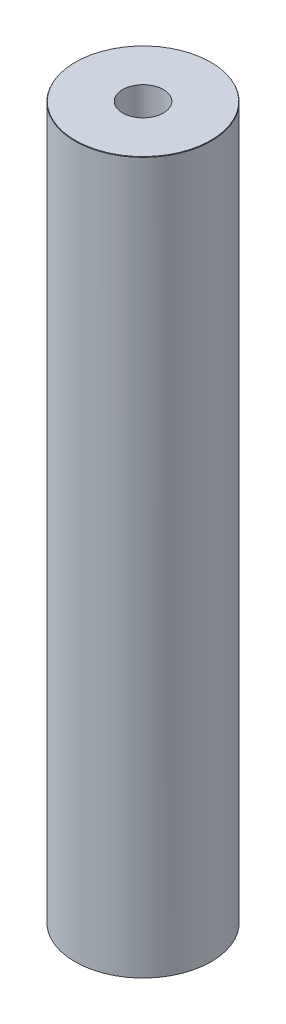
ISO-10303-21;
HEADER;
FILE_DESCRIPTION(('STEP AP214'),'2;1');
FILE_NAME('part.step','',(''),(''),'','','');
FILE_SCHEMA(('AUTOMOTIVE_DESIGN { 1 0 10303 214 1 1 1 1 }'));
ENDSEC;
DATA;
#1=APPLICATION_CONTEXT('core data for automotive mechanical design processes');
#2=APPLICATION_PROTOCOL_DEFINITION('international standard','automotive_design',2000,#1);
#3=PRODUCT_CONTEXT('',#1,'mechanical');
#4=PRODUCT('Part','Part','',(#3));
#5=PRODUCT_RELATED_PRODUCT_CATEGORY('part','',(#4));
#6=PRODUCT_DEFINITION_FORMATION('','',#4);
#7=PRODUCT_DEFINITION_CONTEXT('part definition',#1,'design');
#8=PRODUCT_DEFINITION('design','',#6,#7);
#9=PRODUCT_DEFINITION_SHAPE('','',#8);
#10=(LENGTH_UNIT() NAMED_UNIT(*) SI_UNIT(.MILLI.,.METRE.));
#11=(NAMED_UNIT(*) PLANE_ANGLE_UNIT() SI_UNIT($,.RADIAN.));
#12=(NAMED_UNIT(*) SI_UNIT($,.STERADIAN.) SOLID_ANGLE_UNIT());
#13=UNCERTAINTY_MEASURE_WITH_UNIT(LENGTH_MEASURE(1.E-05),#10,'distance_accuracy_value','');
#14=(GEOMETRIC_REPRESENTATION_CONTEXT(3) GLOBAL_UNCERTAINTY_ASSIGNED_CONTEXT((#13)) GLOBAL_UNIT_ASSIGNED_CONTEXT((#10,
#11,#12)) REPRESENTATION_CONTEXT('',''));
#15=CARTESIAN_POINT('',(0.,0.,0.));
#16=DIRECTION('',(0.,0.,1.));
#17=DIRECTION('',(1.,0.,0.));
#18=AXIS2_PLACEMENT_3D('',#15,#16,#17);
#19=CARTESIAN_POINT('',(0.,575.026899895503,0.));
#20=DIRECTION('',(0.,-1.,0.));
#21=DIRECTION('',(0.,0.,-1.));
#22=AXIS2_PLACEMENT_3D('',#19,#20,#21);
#23=CYLINDRICAL_SURFACE('',#22,55.);
#24=CARTESIAN_POINT('',(0.,574.61907468756,0.));
#25=DIRECTION('',(0.,1.,0.));
#26=DIRECTION('',(0.,0.,1.));
#27=AXIS2_PLACEMENT_3D('',#24,#25,#26);
#28=CIRCLE('',#27,55.);
#29=CARTESIAN_POINT('',(0.,574.61907468756,-55.));
#30=VERTEX_POINT('',#29);
#31=EDGE_CURVE('E50',#30,#30,#28,.F.);
#32=ORIENTED_EDGE('',*,*,#31,.T.);
#33=EDGE_LOOP('',(#32));
#34=FACE_BOUND('',#33,.T.);
#35=CARTESIAN_POINT('',(0.,0.235457993588706,0.));
#36=DIRECTION('',(0.,1.,0.));
#37=DIRECTION('',(0.,0.,1.));
#38=AXIS2_PLACEMENT_3D('',#35,#36,#37);
#39=CIRCLE('',#38,55.);
#40=CARTESIAN_POINT('',(0.,0.235457993588706,55.));
#41=VERTEX_POINT('',#40);
#42=EDGE_CURVE('E51',#41,#41,#39,.T.);
#43=ORIENTED_EDGE('',*,*,#42,.T.);
#44=EDGE_LOOP('',(#43));
#45=FACE_BOUND('',#44,.T.);
#46=ADVANCED_FACE('F39',(#34,#45),#23,.T.);
#47=CARTESIAN_POINT('',(0.,575.026899895503,0.));
#48=DIRECTION('',(0.,1.,0.));
#49=DIRECTION('',(0.,0.,1.));
#50=AXIS2_PLACEMENT_3D('',#47,#48,#49);
#51=PLANE('',#50);
#52=CARTESIAN_POINT('',(0.,575.026899895503,0.));
#53=DIRECTION('',(0.,1.,0.));
#54=DIRECTION('',(0.,0.,1.));
#55=AXIS2_PLACEMENT_3D('',#52,#53,#54);
#56=CIRCLE('',#55,54.7645420064112);
#57=CARTESIAN_POINT('',(0.,575.026899895503,-54.7645420064113));
#58=VERTEX_POINT('',#57);
#59=EDGE_CURVE('E54',#58,#58,#56,.T.);
#60=ORIENTED_EDGE('',*,*,#59,.T.);
#61=EDGE_LOOP('',(#60));
#62=FACE_BOUND('',#61,.T.);
#63=CARTESIAN_POINT('',(0.,575.026899895503,0.));
#64=DIRECTION('',(0.,1.,0.));
#65=DIRECTION('',(0.,0.,1.));
#66=AXIS2_PLACEMENT_3D('',#63,#64,#65);
#67=CIRCLE('',#66,16.4650582973961);
#68=CARTESIAN_POINT('',(0.,575.026899895503,16.4650582973961));
#69=VERTEX_POINT('',#68);
#70=EDGE_CURVE('E58',#69,#69,#67,.T.);
#71=ORIENTED_EDGE('',*,*,#70,.F.);
#72=EDGE_LOOP('',(#71));
#73=FACE_BOUND('',#72,.T.);
#74=ADVANCED_FACE('F69',(#62,#73),#51,.T.);
#75=CARTESIAN_POINT('',(0.,0.,0.));
#76=DIRECTION('',(0.,1.,0.));
#77=DIRECTION('',(0.,0.,1.));
#78=AXIS2_PLACEMENT_3D('',#75,#76,#77);
#79=PLANE('',#78);
#80=CARTESIAN_POINT('',(0.,0.,0.));
#81=DIRECTION('',(0.,1.,0.));
#82=DIRECTION('',(0.,0.,1.));
#83=AXIS2_PLACEMENT_3D('',#80,#81,#82);
#84=CIRCLE('',#83,54.5921747920561);
#85=CARTESIAN_POINT('',(0.,0.,54.5921747920561));
#86=VERTEX_POINT('',#85);
#87=EDGE_CURVE('E10',#86,#86,#84,.F.);
#88=ORIENTED_EDGE('',*,*,#87,.T.);
#89=EDGE_LOOP('',(#88));
#90=FACE_BOUND('',#89,.T.);
#91=CARTESIAN_POINT('',(0.,0.,0.));
#92=DIRECTION('',(0.,1.,0.));
#93=DIRECTION('',(0.,0.,1.));
#94=AXIS2_PLACEMENT_3D('',#91,#92,#93);
#95=CIRCLE('',#94,16.4650582973961);
#96=CARTESIAN_POINT('',(0.,0.,16.4650582973961));
#97=VERTEX_POINT('',#96);
#98=EDGE_CURVE('E63',#97,#97,#95,.T.);
#99=ORIENTED_EDGE('',*,*,#98,.T.);
#100=EDGE_LOOP('',(#99));
#101=FACE_BOUND('',#100,.T.);
#102=ADVANCED_FACE('F75',(#90,#101),#79,.F.);
#103=CARTESIAN_POINT('',(0.,575.026899895503,0.));
#104=DIRECTION('',(0.,-1.,0.));
#105=DIRECTION('',(0.,0.,-1.));
#106=AXIS2_PLACEMENT_3D('',#103,#104,#105);
#107=CYLINDRICAL_SURFACE('',#106,16.4650582973961);
#108=ORIENTED_EDGE('',*,*,#70,.T.);
#109=EDGE_LOOP('',(#108));
#110=FACE_BOUND('',#109,.T.);
#111=ORIENTED_EDGE('',*,*,#98,.F.);
#112=EDGE_LOOP('',(#111));
#113=FACE_BOUND('',#112,.T.);
#114=ADVANCED_FACE('F70',(#110,#113),#107,.F.);
#115=CARTESIAN_POINT('',(0.,575.026899895503,0.));
#116=DIRECTION('',(0.,-1.,0.));
#117=DIRECTION('',(0.,0.,-1.));
#118=AXIS2_PLACEMENT_3D('',#115,#116,#117);
#119=CONICAL_SURFACE('',#118,54.7645420064112,0.523598775598364);
#120=CARTESIAN_POINT('',(0.,574.61907468756,-55.));
#121=CARTESIAN_POINT('',(0.,574.623322866809,-54.9975473125668));
#122=CARTESIAN_POINT('',(0.,574.627571046058,-54.9950946251336));
#123=CARTESIAN_POINT('',(0.,574.636067404557,-54.9901892502672));
#124=CARTESIAN_POINT('',(0.,574.640315583807,-54.987736562834));
#125=CARTESIAN_POINT('',(0.,574.648811942305,-54.9828311879675));
#126=CARTESIAN_POINT('',(0.,574.653060121555,-54.9803785005343));
#127=CARTESIAN_POINT('',(0.,574.661556480054,-54.9754731256679));
#128=CARTESIAN_POINT('',(0.,574.665804659303,-54.9730204382346));
#129=CARTESIAN_POINT('',(0.,574.674301017802,-54.9681150633682));
#130=CARTESIAN_POINT('',(0.,574.678549197051,-54.965662375935));
#131=CARTESIAN_POINT('',(0.,574.68704555555,-54.9607570010686));
#132=CARTESIAN_POINT('',(0.,574.6912937348,-54.9583043136354));
#133=CARTESIAN_POINT('',(0.,574.699790093298,-54.9533989387689));
#134=CARTESIAN_POINT('',(0.,574.704038272548,-54.9509462513357));
#135=CARTESIAN_POINT('',(0.,574.712534631047,-54.9460408764693));
#136=CARTESIAN_POINT('',(0.,574.716782810296,-54.943588189036));
#137=CARTESIAN_POINT('',(0.,574.725279168795,-54.9386828141696));
#138=CARTESIAN_POINT('',(0.,574.729527348044,-54.9362301267364));
#139=CARTESIAN_POINT('',(0.,574.738023706543,-54.93132475187));
#140=CARTESIAN_POINT('',(0.,574.742271885793,-54.9288720644368));
#141=CARTESIAN_POINT('',(0.,574.750768244291,-54.9239666895703));
#142=CARTESIAN_POINT('',(0.,574.755016423541,-54.9215140021371));
#143=CARTESIAN_POINT('',(0.,574.76351278204,-54.9166086272707));
#144=CARTESIAN_POINT('',(0.,574.767760961289,-54.9141559398375));
#145=CARTESIAN_POINT('',(0.,574.776257319788,-54.909250564971));
#146=CARTESIAN_POINT('',(0.,574.780505499037,-54.9067978775378));
#147=CARTESIAN_POINT('',(0.,574.789001857536,-54.9018925026714));
#148=CARTESIAN_POINT('',(0.,574.793250036786,-54.8994398152382));
#149=CARTESIAN_POINT('',(0.,574.801746395284,-54.8945344403717));
#150=CARTESIAN_POINT('',(0.,574.805994574534,-54.8920817529385));
#151=CARTESIAN_POINT('',(0.,574.814490933033,-54.8871763780721));
#152=CARTESIAN_POINT('',(0.,574.818739112282,-54.8847236906389));
#153=CARTESIAN_POINT('',(0.,574.827235470781,-54.8798183157724));
#154=CARTESIAN_POINT('',(0.,574.83148365003,-54.8773656283392));
#155=CARTESIAN_POINT('',(0.,574.839980008529,-54.8724602534728));
#156=CARTESIAN_POINT('',(0.,574.844228187779,-54.8700075660396));
#157=CARTESIAN_POINT('',(0.,574.852724546277,-54.8651021911731));
#158=CARTESIAN_POINT('',(0.,574.856972725527,-54.8626495037399));
#159=CARTESIAN_POINT('',(0.,574.865469084026,-54.8577441288735));
#160=CARTESIAN_POINT('',(0.,574.869717263275,-54.8552914414403));
#161=CARTESIAN_POINT('',(0.,574.878213621774,-54.8503860665738));
#162=CARTESIAN_POINT('',(0.,574.882461801023,-54.8479333791406));
#163=CARTESIAN_POINT('',(0.,574.890958159522,-54.8430280042742));
#164=CARTESIAN_POINT('',(0.,574.895206338772,-54.840575316841));
#165=CARTESIAN_POINT('',(0.,574.90370269727,-54.8356699419745));
#166=CARTESIAN_POINT('',(0.,574.90795087652,-54.8332172545413));
#167=CARTESIAN_POINT('',(0.,574.916447235019,-54.8283118796749));
#168=CARTESIAN_POINT('',(0.,574.920695414268,-54.8258591922417));
#169=CARTESIAN_POINT('',(0.,574.929191772767,-54.8209538173752));
#170=CARTESIAN_POINT('',(0.,574.933439952016,-54.818501129942));
#171=CARTESIAN_POINT('',(0.,574.941936310515,-54.8135957550756));
#172=CARTESIAN_POINT('',(0.,574.946184489765,-54.8111430676424));
#173=CARTESIAN_POINT('',(0.,574.954680848263,-54.8062376927759));
#174=CARTESIAN_POINT('',(0.,574.958929027513,-54.8037850053427));
#175=CARTESIAN_POINT('',(0.,574.967425386012,-54.7988796304763));
#176=CARTESIAN_POINT('',(0.,574.971673565261,-54.7964269430431));
#177=CARTESIAN_POINT('',(0.,574.98016992376,-54.7915215681766));
#178=CARTESIAN_POINT('',(0.,574.984418103009,-54.7890688807434));
#179=CARTESIAN_POINT('',(0.,574.992914461508,-54.784163505877));
#180=CARTESIAN_POINT('',(0.,574.997162640758,-54.7817108184438));
#181=CARTESIAN_POINT('',(0.,575.005658999256,-54.7768054435773));
#182=CARTESIAN_POINT('',(0.,575.009907178506,-54.7743527561441));
#183=CARTESIAN_POINT('',(0.,575.018403537005,-54.7694473812777));
#184=CARTESIAN_POINT('',(0.,575.022651716254,-54.7669946938445));
#185=CARTESIAN_POINT('',(0.,575.026899895503,-54.7645420064113));
#186=B_SPLINE_CURVE_WITH_KNOTS('',3,(#120,#121,#122,#123,#124,#125,#126,#127,#128,#129,#130,
#131,#132,#133,#134,#135,#136,#137,#138,#139,#140,#141,#142,#143,#144,#145,#146,#147,#148,#149,
#150,#151,#152,#153,#154,#155,#156,#157,#158,#159,#160,#161,#162,#163,#164,#165,#166,#167,#168,
#169,#170,#171,#172,#173,#174,#175,#176,#177,#178,#179,#180,#181,#182,#183,#184,#185),
.UNSPECIFIED.,.F.,.F.,(4,2,2,2,2,2,2,2,2,2,2,2,2,2,2,2,2,2,2,2,2,2,2,2,2,2,2,2,2,2,2,2,4),(0.,
0.0147161245992941,0.0294322491985882,0.0441483737978824,0.0588644983971765,0.0735806229964671,
0.0882967475957613,0.103012872195055,0.11772899679435,0.13244512139364,0.147161245992934,
0.161877370592228,0.176593495191522,0.191309619790817,0.206025744390107,0.220741868989401,
0.235457993588695,0.25017411818799,0.26489024278728,0.279606367386574,0.294322491985868,
0.309038616585163,0.323754741184457,0.338470865783747,0.353186990383041,0.367903114982336,
0.38261923958163,0.39733536418092,0.412051488780214,0.426767613379509,0.441483737978803,
0.456199862578097,0.470915987177484),.UNSPECIFIED.);
#187=EDGE_CURVE('BSEAM81',#30,#58,#186,.T.);
#188=ORIENTED_EDGE('',*,*,#31,.F.);
#189=ORIENTED_EDGE('',*,*,#59,.F.);
#190=ORIENTED_EDGE('',*,*,#187,.T.);
#191=ORIENTED_EDGE('',*,*,#187,.F.);
#192=EDGE_LOOP('',(#188,#190,#189,#191));
#193=FACE_BOUND('',#192,.T.);
#194=ADVANCED_FACE('F81',(#193),#119,.T.);
#195=CARTESIAN_POINT('',(0.,0.235457993588706,0.));
#196=DIRECTION('',(0.,1.,0.));
#197=DIRECTION('',(0.,0.,1.));
#198=AXIS2_PLACEMENT_3D('',#195,#196,#197);
#199=CONICAL_SURFACE('',#198,55.,1.0471975511966);
#200=ORIENTED_EDGE('',*,*,#87,.F.);
#201=EDGE_LOOP('',(#200));
#202=FACE_BOUND('',#201,.T.);
#203=ORIENTED_EDGE('',*,*,#42,.F.);
#204=EDGE_LOOP('',(#203));
#205=FACE_BOUND('',#204,.T.);
#206=ADVANCED_FACE('F45',(#202,#205),#199,.T.);
#207=CLOSED_SHELL('',(#46,#74,#102,#114,#194,#206));
#208=MANIFOLD_SOLID_BREP('B2',#207);
#209=ADVANCED_BREP_SHAPE_REPRESENTATION('',(#18,#208),#14);
#210=SHAPE_DEFINITION_REPRESENTATION(#9,#209);
ENDSEC;
END-ISO-10303-21;
